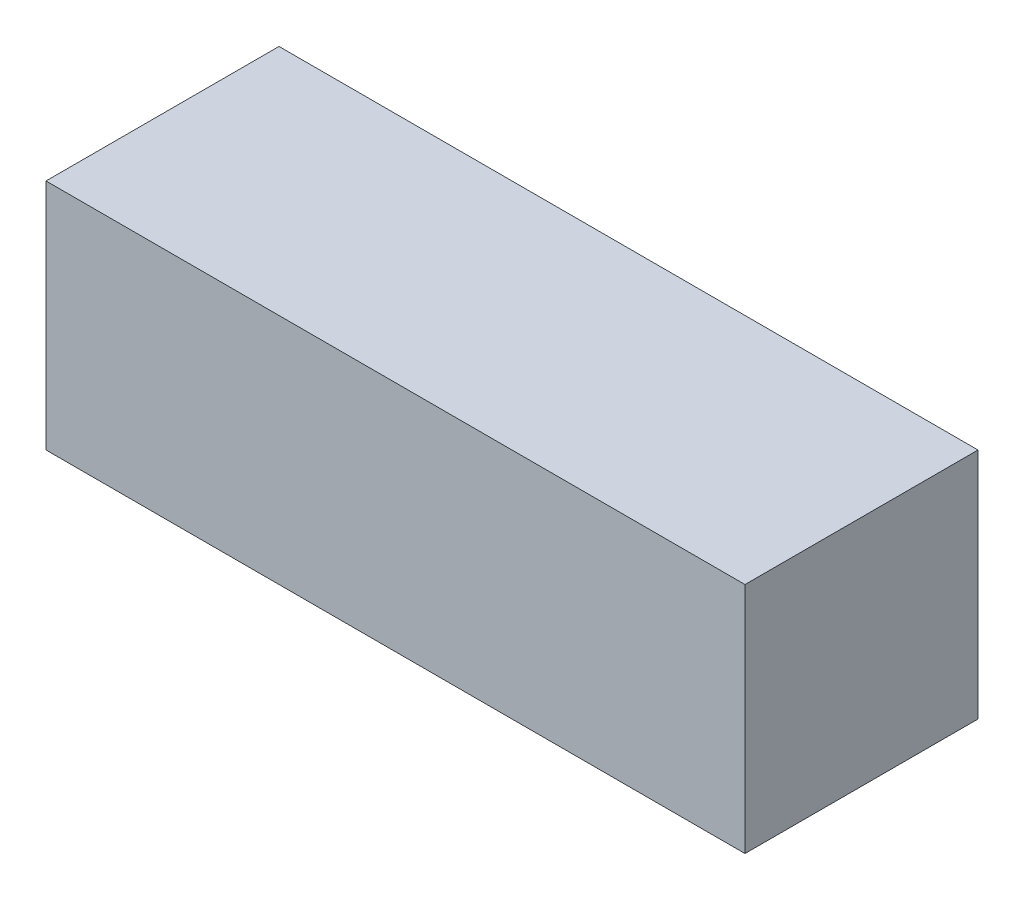
ISO-10303-21;
HEADER;
FILE_DESCRIPTION(('STEP AP214'),'2;1');
FILE_NAME('part.step','',(''),(''),'','','');
FILE_SCHEMA(('AUTOMOTIVE_DESIGN { 1 0 10303 214 1 1 1 1 }'));
ENDSEC;
DATA;
#1=APPLICATION_CONTEXT('core data for automotive mechanical design processes');
#2=APPLICATION_PROTOCOL_DEFINITION('international standard','automotive_design',2000,#1);
#3=PRODUCT_CONTEXT('',#1,'mechanical');
#4=PRODUCT('Part','Part','',(#3));
#5=PRODUCT_RELATED_PRODUCT_CATEGORY('part','',(#4));
#6=PRODUCT_DEFINITION_FORMATION('','',#4);
#7=PRODUCT_DEFINITION_CONTEXT('part definition',#1,'design');
#8=PRODUCT_DEFINITION('design','',#6,#7);
#9=PRODUCT_DEFINITION_SHAPE('','',#8);
#10=(LENGTH_UNIT() NAMED_UNIT(*) SI_UNIT(.MILLI.,.METRE.));
#11=(NAMED_UNIT(*) PLANE_ANGLE_UNIT() SI_UNIT($,.RADIAN.));
#12=(NAMED_UNIT(*) SI_UNIT($,.STERADIAN.) SOLID_ANGLE_UNIT());
#13=UNCERTAINTY_MEASURE_WITH_UNIT(LENGTH_MEASURE(1.E-05),#10,'distance_accuracy_value','');
#14=(GEOMETRIC_REPRESENTATION_CONTEXT(3) GLOBAL_UNCERTAINTY_ASSIGNED_CONTEXT((#13)) GLOBAL_UNIT_ASSIGNED_CONTEXT((#10,
#11,#12)) REPRESENTATION_CONTEXT('',''));
#15=CARTESIAN_POINT('',(0.,0.,0.));
#16=DIRECTION('',(0.,0.,1.));
#17=DIRECTION('',(1.,0.,0.));
#18=AXIS2_PLACEMENT_3D('',#15,#16,#17);
#19=CARTESIAN_POINT('',(300.,67.824503580319,41.147127564224));
#20=DIRECTION('',(0.,0.,-1.));
#21=DIRECTION('',(0.,1.,0.));
#22=AXIS2_PLACEMENT_3D('',#19,#20,#21);
#23=PLANE('',#22);
#24=DIRECTION('',(0.,-1.,0.));
#25=VECTOR('',#24,1.);
#26=CARTESIAN_POINT('',(0.,67.824503580319,41.147127564224));
#27=LINE('',#26,#25);
#28=CARTESIAN_POINT('',(0.,67.824503580319,41.147127564224));
#29=VERTEX_POINT('',#28);
#30=CARTESIAN_POINT('',(0.,-32.175496419681,41.1471275642239));
#31=VERTEX_POINT('',#30);
#32=EDGE_CURVE('E107',#29,#31,#27,.T.);
#33=ORIENTED_EDGE('',*,*,#32,.T.);
#34=DIRECTION('',(-1.,0.,0.));
#35=VECTOR('',#34,1.);
#36=CARTESIAN_POINT('',(300.,-32.175496419681,41.1471275642239));
#37=LINE('',#36,#35);
#38=CARTESIAN_POINT('',(300.,-32.175496419681,41.1471275642239));
#39=VERTEX_POINT('',#38);
#40=EDGE_CURVE('E11',#39,#31,#37,.T.);
#41=ORIENTED_EDGE('',*,*,#40,.F.);
#42=DIRECTION('',(0.,-1.,0.));
#43=VECTOR('',#42,1.);
#44=CARTESIAN_POINT('',(300.,67.824503580319,41.147127564224));
#45=LINE('',#44,#43);
#46=CARTESIAN_POINT('',(300.,67.824503580319,41.147127564224));
#47=VERTEX_POINT('',#46);
#48=EDGE_CURVE('E91',#47,#39,#45,.T.);
#49=ORIENTED_EDGE('',*,*,#48,.F.);
#50=DIRECTION('',(-1.,0.,0.));
#51=VECTOR('',#50,1.);
#52=CARTESIAN_POINT('',(300.,67.824503580319,41.147127564224));
#53=LINE('',#52,#51);
#54=EDGE_CURVE('E103',#47,#29,#53,.T.);
#55=ORIENTED_EDGE('',*,*,#54,.T.);
#56=EDGE_LOOP('',(#33,#41,#49,#55));
#57=FACE_BOUND('',#56,.T.);
#58=ADVANCED_FACE('F39',(#57),#23,.F.);
#59=CARTESIAN_POINT('',(300.,-32.175496419681,41.1471275642239));
#60=DIRECTION('',(0.,1.,0.));
#61=DIRECTION('',(0.,0.,1.));
#62=AXIS2_PLACEMENT_3D('',#59,#60,#61);
#63=PLANE('',#62);
#64=DIRECTION('',(0.,0.,-1.));
#65=VECTOR('',#64,1.);
#66=CARTESIAN_POINT('',(0.,-32.175496419681,41.1471275642239));
#67=LINE('',#66,#65);
#68=CARTESIAN_POINT('',(0.,-32.175496419681,-58.8528724357761));
#69=VERTEX_POINT('',#68);
#70=EDGE_CURVE('E96',#31,#69,#67,.T.);
#71=ORIENTED_EDGE('',*,*,#70,.T.);
#72=DIRECTION('',(-1.,0.,0.));
#73=VECTOR('',#72,1.);
#74=CARTESIAN_POINT('',(300.,-32.175496419681,-58.8528724357761));
#75=LINE('',#74,#73);
#76=CARTESIAN_POINT('',(300.,-32.175496419681,-58.8528724357761));
#77=VERTEX_POINT('',#76);
#78=EDGE_CURVE('E48',#77,#69,#75,.T.);
#79=ORIENTED_EDGE('',*,*,#78,.F.);
#80=DIRECTION('',(0.,0.,-1.));
#81=VECTOR('',#80,1.);
#82=CARTESIAN_POINT('',(300.,-32.175496419681,41.1471275642239));
#83=LINE('',#82,#81);
#84=EDGE_CURVE('E86',#39,#77,#83,.T.);
#85=ORIENTED_EDGE('',*,*,#84,.F.);
#86=ORIENTED_EDGE('',*,*,#40,.T.);
#87=EDGE_LOOP('',(#71,#79,#85,#86));
#88=FACE_BOUND('',#87,.T.);
#89=ADVANCED_FACE('F95',(#88),#63,.F.);
#90=CARTESIAN_POINT('',(300.,67.824503580319,-58.852872435776));
#91=DIRECTION('',(0.,0.,1.));
#92=DIRECTION('',(0.,-1.,0.));
#93=AXIS2_PLACEMENT_3D('',#90,#91,#92);
#94=PLANE('',#93);
#95=DIRECTION('',(0.,1.,0.));
#96=VECTOR('',#95,1.);
#97=CARTESIAN_POINT('',(0.,67.824503580319,-58.852872435776));
#98=LINE('',#97,#96);
#99=CARTESIAN_POINT('',(0.,67.824503580319,-58.852872435776));
#100=VERTEX_POINT('',#99);
#101=EDGE_CURVE('E73',#69,#100,#98,.T.);
#102=ORIENTED_EDGE('',*,*,#101,.T.);
#103=DIRECTION('',(-1.,0.,0.));
#104=VECTOR('',#103,1.);
#105=CARTESIAN_POINT('',(300.,67.824503580319,-58.852872435776));
#106=LINE('',#105,#104);
#107=CARTESIAN_POINT('',(300.,67.824503580319,-58.852872435776));
#108=VERTEX_POINT('',#107);
#109=EDGE_CURVE('E98',#108,#100,#106,.T.);
#110=ORIENTED_EDGE('',*,*,#109,.F.);
#111=DIRECTION('',(0.,1.,0.));
#112=VECTOR('',#111,1.);
#113=CARTESIAN_POINT('',(300.,67.824503580319,-58.852872435776));
#114=LINE('',#113,#112);
#115=EDGE_CURVE('E89',#77,#108,#114,.T.);
#116=ORIENTED_EDGE('',*,*,#115,.F.);
#117=ORIENTED_EDGE('',*,*,#78,.T.);
#118=EDGE_LOOP('',(#102,#110,#116,#117));
#119=FACE_BOUND('',#118,.T.);
#120=ADVANCED_FACE('F99',(#119),#94,.F.);
#121=CARTESIAN_POINT('',(300.,67.824503580319,41.147127564224));
#122=DIRECTION('',(0.,-1.,0.));
#123=DIRECTION('',(0.,0.,-1.));
#124=AXIS2_PLACEMENT_3D('',#121,#122,#123);
#125=PLANE('',#124);
#126=DIRECTION('',(0.,0.,1.));
#127=VECTOR('',#126,1.);
#128=CARTESIAN_POINT('',(0.,67.824503580319,41.147127564224));
#129=LINE('',#128,#127);
#130=EDGE_CURVE('E79',#100,#29,#129,.T.);
#131=ORIENTED_EDGE('',*,*,#130,.T.);
#132=ORIENTED_EDGE('',*,*,#54,.F.);
#133=DIRECTION('',(0.,0.,1.));
#134=VECTOR('',#133,1.);
#135=CARTESIAN_POINT('',(300.,67.824503580319,41.147127564224));
#136=LINE('',#135,#134);
#137=EDGE_CURVE('E56',#108,#47,#136,.T.);
#138=ORIENTED_EDGE('',*,*,#137,.F.);
#139=ORIENTED_EDGE('',*,*,#109,.T.);
#140=EDGE_LOOP('',(#131,#132,#138,#139));
#141=FACE_BOUND('',#140,.T.);
#142=ADVANCED_FACE('F120',(#141),#125,.F.);
#143=CARTESIAN_POINT('',(300.,0.,0.));
#144=DIRECTION('',(1.,0.,0.));
#145=DIRECTION('',(0.,0.,-1.));
#146=AXIS2_PLACEMENT_3D('',#143,#144,#145);
#147=PLANE('',#146);
#148=ORIENTED_EDGE('',*,*,#48,.T.);
#149=ORIENTED_EDGE('',*,*,#84,.T.);
#150=ORIENTED_EDGE('',*,*,#115,.T.);
#151=ORIENTED_EDGE('',*,*,#137,.T.);
#152=EDGE_LOOP('',(#148,#149,#150,#151));
#153=FACE_BOUND('',#152,.T.);
#154=ADVANCED_FACE('F87',(#153),#147,.T.);
#155=CARTESIAN_POINT('',(0.,0.,0.));
#156=DIRECTION('',(1.,0.,0.));
#157=DIRECTION('',(0.,0.,-1.));
#158=AXIS2_PLACEMENT_3D('',#155,#156,#157);
#159=PLANE('',#158);
#160=ORIENTED_EDGE('',*,*,#32,.F.);
#161=ORIENTED_EDGE('',*,*,#130,.F.);
#162=ORIENTED_EDGE('',*,*,#101,.F.);
#163=ORIENTED_EDGE('',*,*,#70,.F.);
#164=EDGE_LOOP('',(#160,#161,#162,#163));
#165=FACE_BOUND('',#164,.T.);
#166=ADVANCED_FACE('F123',(#165),#159,.F.);
#167=CLOSED_SHELL('',(#58,#89,#120,#142,#154,#166));
#168=MANIFOLD_SOLID_BREP('B2',#167);
#169=ADVANCED_BREP_SHAPE_REPRESENTATION('',(#18,#168),#14);
#170=SHAPE_DEFINITION_REPRESENTATION(#9,#169);
ENDSEC;
END-ISO-10303-21;
